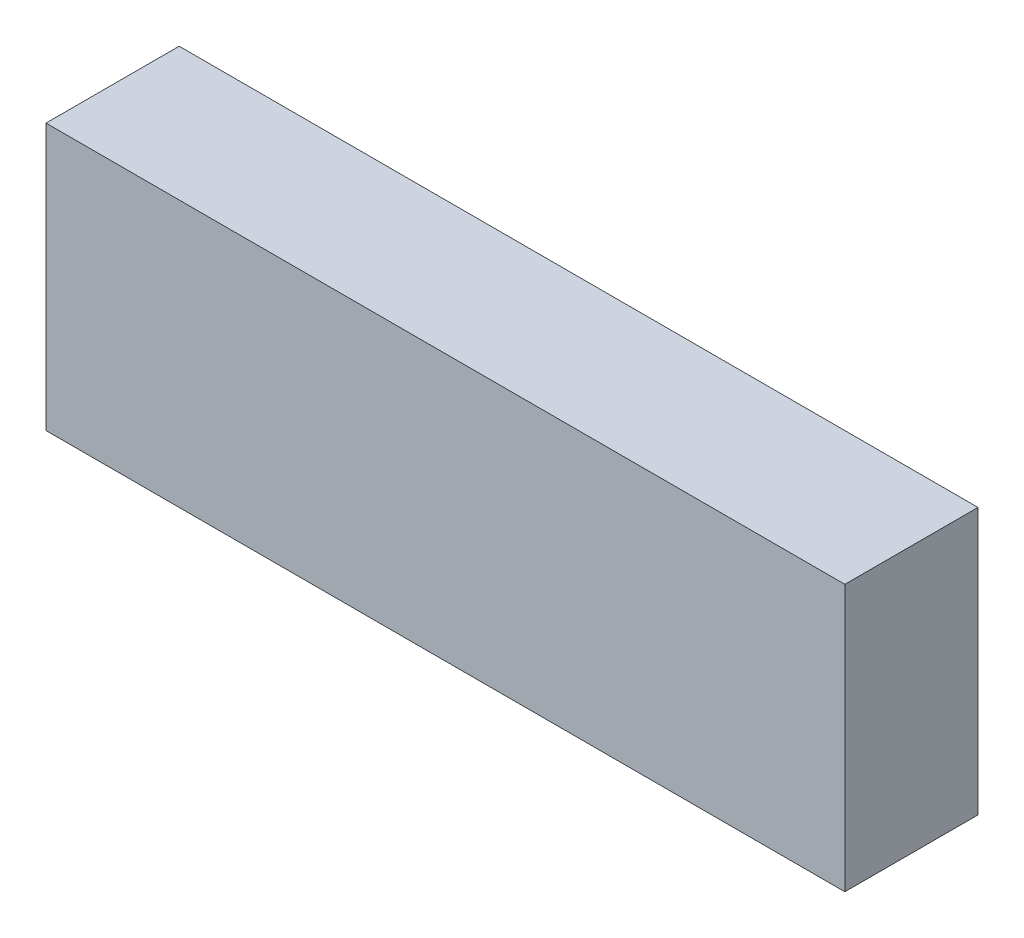
ISO-10303-21;
HEADER;
FILE_DESCRIPTION(('STEP AP214'),'2;1');
FILE_NAME('part.step','',(''),(''),'','','');
FILE_SCHEMA(('AUTOMOTIVE_DESIGN { 1 0 10303 214 1 1 1 1 }'));
ENDSEC;
DATA;
#1=APPLICATION_CONTEXT('core data for automotive mechanical design processes');
#2=APPLICATION_PROTOCOL_DEFINITION('international standard','automotive_design',2000,#1);
#3=PRODUCT_CONTEXT('',#1,'mechanical');
#4=PRODUCT('Part','Part','',(#3));
#5=PRODUCT_RELATED_PRODUCT_CATEGORY('part','',(#4));
#6=PRODUCT_DEFINITION_FORMATION('','',#4);
#7=PRODUCT_DEFINITION_CONTEXT('part definition',#1,'design');
#8=PRODUCT_DEFINITION('design','',#6,#7);
#9=PRODUCT_DEFINITION_SHAPE('','',#8);
#10=(LENGTH_UNIT() NAMED_UNIT(*) SI_UNIT(.MILLI.,.METRE.));
#11=(NAMED_UNIT(*) PLANE_ANGLE_UNIT() SI_UNIT($,.RADIAN.));
#12=(NAMED_UNIT(*) SI_UNIT($,.STERADIAN.) SOLID_ANGLE_UNIT());
#13=UNCERTAINTY_MEASURE_WITH_UNIT(LENGTH_MEASURE(1.E-05),#10,'distance_accuracy_value','');
#14=(GEOMETRIC_REPRESENTATION_CONTEXT(3) GLOBAL_UNCERTAINTY_ASSIGNED_CONTEXT((#13)) GLOBAL_UNIT_ASSIGNED_CONTEXT((#10,
#11,#12)) REPRESENTATION_CONTEXT('',''));
#15=CARTESIAN_POINT('',(0.,0.,0.));
#16=DIRECTION('',(0.,0.,1.));
#17=DIRECTION('',(1.,0.,0.));
#18=AXIS2_PLACEMENT_3D('',#15,#16,#17);
#19=CARTESIAN_POINT('',(-1.975,0.875,0.));
#20=DIRECTION('',(1.,0.,0.));
#21=DIRECTION('',(0.,0.,1.));
#22=AXIS2_PLACEMENT_3D('',#19,#20,#21);
#23=PLANE('',#22);
#24=DIRECTION('',(0.,1.,0.));
#25=VECTOR('',#24,1.);
#26=CARTESIAN_POINT('',(-1.975,0.875,0.1));
#27=LINE('',#26,#25);
#28=CARTESIAN_POINT('',(-1.975,0.875,0.1));
#29=VERTEX_POINT('',#28);
#30=CARTESIAN_POINT('',(-1.975,1.075,0.1));
#31=VERTEX_POINT('',#30);
#32=EDGE_CURVE('E11',#29,#31,#27,.T.);
#33=ORIENTED_EDGE('',*,*,#32,.T.);
#34=DIRECTION('',(0.,0.,1.));
#35=VECTOR('',#34,1.);
#36=CARTESIAN_POINT('',(-1.975,1.075,0.));
#37=LINE('',#36,#35);
#38=CARTESIAN_POINT('',(-1.975,1.075,0.));
#39=VERTEX_POINT('',#38);
#40=EDGE_CURVE('E24',#39,#31,#37,.T.);
#41=ORIENTED_EDGE('',*,*,#40,.F.);
#42=DIRECTION('',(0.,1.,0.));
#43=VECTOR('',#42,1.);
#44=CARTESIAN_POINT('',(-1.975,0.875,0.));
#45=LINE('',#44,#43);
#46=CARTESIAN_POINT('',(-1.975,0.875,0.));
#47=VERTEX_POINT('',#46);
#48=EDGE_CURVE('E86',#47,#39,#45,.T.);
#49=ORIENTED_EDGE('',*,*,#48,.F.);
#50=DIRECTION('',(0.,0.,1.));
#51=VECTOR('',#50,1.);
#52=CARTESIAN_POINT('',(-1.975,0.875,0.));
#53=LINE('',#52,#51);
#54=EDGE_CURVE('E36',#47,#29,#53,.T.);
#55=ORIENTED_EDGE('',*,*,#54,.T.);
#56=EDGE_LOOP('',(#33,#41,#49,#55));
#57=FACE_BOUND('',#56,.T.);
#58=ADVANCED_FACE('F17',(#57),#23,.F.);
#59=CARTESIAN_POINT('',(-1.375,0.875,0.));
#60=DIRECTION('',(1.,0.,0.));
#61=DIRECTION('',(0.,0.,1.));
#62=AXIS2_PLACEMENT_3D('',#59,#60,#61);
#63=PLANE('',#62);
#64=DIRECTION('',(0.,0.,1.));
#65=VECTOR('',#64,1.);
#66=CARTESIAN_POINT('',(-1.375,0.875,0.));
#67=LINE('',#66,#65);
#68=CARTESIAN_POINT('',(-1.375,0.875,0.));
#69=VERTEX_POINT('',#68);
#70=CARTESIAN_POINT('',(-1.375,0.875,0.1));
#71=VERTEX_POINT('',#70);
#72=EDGE_CURVE('E83',#69,#71,#67,.T.);
#73=ORIENTED_EDGE('',*,*,#72,.F.);
#74=DIRECTION('',(0.,1.,0.));
#75=VECTOR('',#74,1.);
#76=CARTESIAN_POINT('',(-1.375,0.875,0.));
#77=LINE('',#76,#75);
#78=CARTESIAN_POINT('',(-1.375,1.075,0.));
#79=VERTEX_POINT('',#78);
#80=EDGE_CURVE('E63',#69,#79,#77,.T.);
#81=ORIENTED_EDGE('',*,*,#80,.T.);
#82=DIRECTION('',(0.,0.,1.));
#83=VECTOR('',#82,1.);
#84=CARTESIAN_POINT('',(-1.375,1.075,0.));
#85=LINE('',#84,#83);
#86=CARTESIAN_POINT('',(-1.375,1.075,0.1));
#87=VERTEX_POINT('',#86);
#88=EDGE_CURVE('E57',#79,#87,#85,.T.);
#89=ORIENTED_EDGE('',*,*,#88,.T.);
#90=DIRECTION('',(0.,1.,0.));
#91=VECTOR('',#90,1.);
#92=CARTESIAN_POINT('',(-1.375,0.875,0.1));
#93=LINE('',#92,#91);
#94=EDGE_CURVE('E60',#71,#87,#93,.T.);
#95=ORIENTED_EDGE('',*,*,#94,.F.);
#96=EDGE_LOOP('',(#73,#81,#89,#95));
#97=FACE_BOUND('',#96,.T.);
#98=ADVANCED_FACE('F59',(#97),#63,.T.);
#99=CARTESIAN_POINT('',(-1.975,0.875,0.));
#100=DIRECTION('',(0.,1.,0.));
#101=DIRECTION('',(0.,0.,1.));
#102=AXIS2_PLACEMENT_3D('',#99,#100,#101);
#103=PLANE('',#102);
#104=ORIENTED_EDGE('',*,*,#72,.T.);
#105=DIRECTION('',(1.,0.,0.));
#106=VECTOR('',#105,1.);
#107=CARTESIAN_POINT('',(-1.975,0.875,0.1));
#108=LINE('',#107,#106);
#109=EDGE_CURVE('E71',#29,#71,#108,.T.);
#110=ORIENTED_EDGE('',*,*,#109,.F.);
#111=ORIENTED_EDGE('',*,*,#54,.F.);
#112=DIRECTION('',(1.,0.,0.));
#113=VECTOR('',#112,1.);
#114=CARTESIAN_POINT('',(-1.975,0.875,0.));
#115=LINE('',#114,#113);
#116=EDGE_CURVE('E76',#47,#69,#115,.T.);
#117=ORIENTED_EDGE('',*,*,#116,.T.);
#118=EDGE_LOOP('',(#104,#110,#111,#117));
#119=FACE_BOUND('',#118,.T.);
#120=ADVANCED_FACE('F91',(#119),#103,.F.);
#121=CARTESIAN_POINT('',(-1.975,1.075,0.));
#122=DIRECTION('',(0.,1.,0.));
#123=DIRECTION('',(0.,0.,1.));
#124=AXIS2_PLACEMENT_3D('',#121,#122,#123);
#125=PLANE('',#124);
#126=DIRECTION('',(1.,0.,0.));
#127=VECTOR('',#126,1.);
#128=CARTESIAN_POINT('',(-1.975,1.075,0.));
#129=LINE('',#128,#127);
#130=EDGE_CURVE('E74',#39,#79,#129,.T.);
#131=ORIENTED_EDGE('',*,*,#130,.F.);
#132=ORIENTED_EDGE('',*,*,#40,.T.);
#133=DIRECTION('',(1.,0.,0.));
#134=VECTOR('',#133,1.);
#135=CARTESIAN_POINT('',(-1.975,1.075,0.1));
#136=LINE('',#135,#134);
#137=EDGE_CURVE('E69',#31,#87,#136,.T.);
#138=ORIENTED_EDGE('',*,*,#137,.T.);
#139=ORIENTED_EDGE('',*,*,#88,.F.);
#140=EDGE_LOOP('',(#131,#132,#138,#139));
#141=FACE_BOUND('',#140,.T.);
#142=ADVANCED_FACE('F73',(#141),#125,.T.);
#143=CARTESIAN_POINT('',(-1.975,0.875,0.));
#144=DIRECTION('',(0.,0.,1.));
#145=DIRECTION('',(1.,0.,0.));
#146=AXIS2_PLACEMENT_3D('',#143,#144,#145);
#147=PLANE('',#146);
#148=ORIENTED_EDGE('',*,*,#130,.T.);
#149=ORIENTED_EDGE('',*,*,#80,.F.);
#150=ORIENTED_EDGE('',*,*,#116,.F.);
#151=ORIENTED_EDGE('',*,*,#48,.T.);
#152=EDGE_LOOP('',(#148,#149,#150,#151));
#153=FACE_BOUND('',#152,.T.);
#154=ADVANCED_FACE('F89',(#153),#147,.F.);
#155=CARTESIAN_POINT('',(-1.975,0.875,0.1));
#156=DIRECTION('',(0.,0.,1.));
#157=DIRECTION('',(1.,0.,0.));
#158=AXIS2_PLACEMENT_3D('',#155,#156,#157);
#159=PLANE('',#158);
#160=ORIENTED_EDGE('',*,*,#32,.F.);
#161=ORIENTED_EDGE('',*,*,#109,.T.);
#162=ORIENTED_EDGE('',*,*,#94,.T.);
#163=ORIENTED_EDGE('',*,*,#137,.F.);
#164=EDGE_LOOP('',(#160,#161,#162,#163));
#165=FACE_BOUND('',#164,.T.);
#166=ADVANCED_FACE('F68',(#165),#159,.T.);
#167=CLOSED_SHELL('',(#58,#98,#120,#142,#154,#166));
#168=MANIFOLD_SOLID_BREP('B1',#167);
#169=ADVANCED_BREP_SHAPE_REPRESENTATION('',(#18,#168),#14);
#170=SHAPE_DEFINITION_REPRESENTATION(#9,#169);
ENDSEC;
END-ISO-10303-21;
